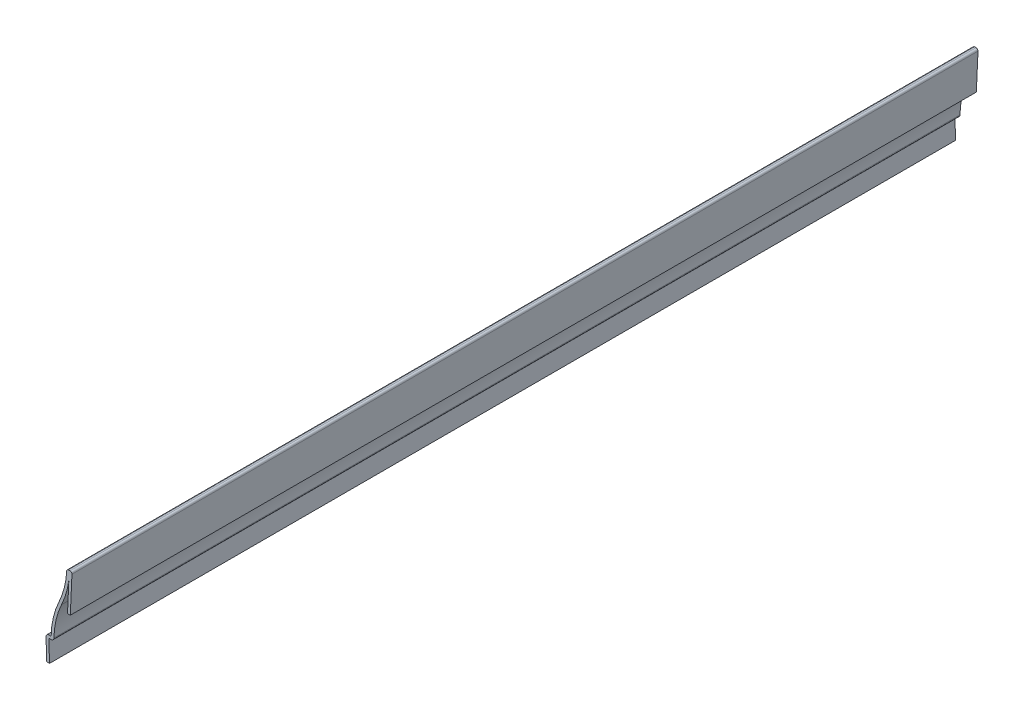
ISO-10303-21;
HEADER;
FILE_DESCRIPTION(('STEP AP214'),'2;1');
FILE_NAME('part.step','',(''),(''),'','','');
FILE_SCHEMA(('AUTOMOTIVE_DESIGN { 1 0 10303 214 1 1 1 1 }'));
ENDSEC;
DATA;
#1=APPLICATION_CONTEXT('core data for automotive mechanical design processes');
#2=APPLICATION_PROTOCOL_DEFINITION('international standard','automotive_design',2000,#1);
#3=PRODUCT_CONTEXT('',#1,'mechanical');
#4=PRODUCT('Part','Part','',(#3));
#5=PRODUCT_RELATED_PRODUCT_CATEGORY('part','',(#4));
#6=PRODUCT_DEFINITION_FORMATION('','',#4);
#7=PRODUCT_DEFINITION_CONTEXT('part definition',#1,'design');
#8=PRODUCT_DEFINITION('design','',#6,#7);
#9=PRODUCT_DEFINITION_SHAPE('','',#8);
#10=(LENGTH_UNIT() NAMED_UNIT(*) SI_UNIT(.MILLI.,.METRE.));
#11=(NAMED_UNIT(*) PLANE_ANGLE_UNIT() SI_UNIT($,.RADIAN.));
#12=(NAMED_UNIT(*) SI_UNIT($,.STERADIAN.) SOLID_ANGLE_UNIT());
#13=UNCERTAINTY_MEASURE_WITH_UNIT(LENGTH_MEASURE(1.E-05),#10,'distance_accuracy_value','');
#14=(GEOMETRIC_REPRESENTATION_CONTEXT(3) GLOBAL_UNCERTAINTY_ASSIGNED_CONTEXT((#13)) GLOBAL_UNIT_ASSIGNED_CONTEXT((#10,
#11,#12)) REPRESENTATION_CONTEXT('',''));
#15=CARTESIAN_POINT('',(0.,0.,0.));
#16=DIRECTION('',(0.,0.,1.));
#17=DIRECTION('',(1.,0.,0.));
#18=AXIS2_PLACEMENT_3D('',#15,#16,#17);
#19=CARTESIAN_POINT('',(10.2406849539329,41.299533746183,412.75));
#20=DIRECTION('',(0.9989685402103,-0.0454076609186499,0.));
#21=DIRECTION('',(0.0454076609186499,0.9989685402103,0.));
#22=AXIS2_PLACEMENT_3D('',#19,#20,#21);
#23=PLANE('',#22);
#24=DIRECTION('',(-0.0454076609186499,-0.9989685402103,0.));
#25=VECTOR('',#24,1.);
#26=CARTESIAN_POINT('',(10.2406849539329,41.299533746183,0.));
#27=LINE('',#26,#25);
#28=CARTESIAN_POINT('',(10.0568661927221,37.2555209995457,0.));
#29=VERTEX_POINT('',#28);
#30=CARTESIAN_POINT('',(9.44693495393292,23.837033746183,0.));
#31=VERTEX_POINT('',#30);
#32=EDGE_CURVE('E171',#29,#31,#27,.T.);
#33=ORIENTED_EDGE('',*,*,#32,.T.);
#34=DIRECTION('',(0.,0.,-1.));
#35=VECTOR('',#34,1.);
#36=CARTESIAN_POINT('',(9.44693495393292,23.837033746183,412.75));
#37=LINE('',#36,#35);
#38=CARTESIAN_POINT('',(9.44693495393292,23.837033746183,412.75));
#39=VERTEX_POINT('',#38);
#40=EDGE_CURVE('E169',#39,#31,#37,.T.);
#41=ORIENTED_EDGE('',*,*,#40,.F.);
#42=DIRECTION('',(-0.0454076609186499,-0.9989685402103,0.));
#43=VECTOR('',#42,1.);
#44=CARTESIAN_POINT('',(10.2406849539329,41.299533746183,412.75));
#45=LINE('',#44,#43);
#46=CARTESIAN_POINT('',(10.0568661927221,37.2555209995457,412.75));
#47=VERTEX_POINT('',#46);
#48=EDGE_CURVE('E156',#47,#39,#45,.T.);
#49=ORIENTED_EDGE('',*,*,#48,.F.);
#50=DIRECTION('',(0.,0.,-1.));
#51=VECTOR('',#50,1.);
#52=CARTESIAN_POINT('',(10.0568661927221,37.2555209995457,412.75));
#53=LINE('',#52,#51);
#54=EDGE_CURVE('E209',#47,#29,#53,.T.);
#55=ORIENTED_EDGE('',*,*,#54,.T.);
#56=EDGE_LOOP('',(#33,#41,#49,#55));
#57=FACE_BOUND('',#56,.T.);
#58=ADVANCED_FACE('F35',(#57),#23,.F.);
#59=CARTESIAN_POINT('',(10.715625,23.7793660168163,412.75));
#60=DIRECTION('',(-0.0454076609186449,-0.9989685402103,0.));
#61=DIRECTION('',(0.9989685402103,-0.0454076609186449,0.));
#62=AXIS2_PLACEMENT_3D('',#59,#60,#61);
#63=PLANE('',#62);
#64=DIRECTION('',(-0.9989685402103,0.0454076609186449,0.));
#65=VECTOR('',#64,1.);
#66=CARTESIAN_POINT('',(10.715625,23.7793660168163,0.));
#67=LINE('',#66,#65);
#68=CARTESIAN_POINT('',(10.715625,23.7793660168163,0.));
#69=VERTEX_POINT('',#68);
#70=EDGE_CURVE('E211',#69,#31,#67,.T.);
#71=ORIENTED_EDGE('',*,*,#70,.F.);
#72=DIRECTION('',(0.,0.,-1.));
#73=VECTOR('',#72,1.);
#74=CARTESIAN_POINT('',(10.715625,23.7793660168163,412.75));
#75=LINE('',#74,#73);
#76=CARTESIAN_POINT('',(10.715625,23.7793660168163,412.75));
#77=VERTEX_POINT('',#76);
#78=EDGE_CURVE('E176',#77,#69,#75,.T.);
#79=ORIENTED_EDGE('',*,*,#78,.F.);
#80=DIRECTION('',(-0.9989685402103,0.0454076609186449,0.));
#81=VECTOR('',#80,1.);
#82=CARTESIAN_POINT('',(10.715625,23.7793660168163,412.75));
#83=LINE('',#82,#81);
#84=EDGE_CURVE('E160',#77,#39,#83,.T.);
#85=ORIENTED_EDGE('',*,*,#84,.T.);
#86=ORIENTED_EDGE('',*,*,#40,.T.);
#87=EDGE_LOOP('',(#71,#79,#85,#86));
#88=FACE_BOUND('',#87,.T.);
#89=ADVANCED_FACE('F179',(#88),#63,.T.);
#90=CARTESIAN_POINT('',(11.509375,41.2418660168163,412.75));
#91=DIRECTION('',(0.9989685402103,-0.0454076609186499,0.));
#92=DIRECTION('',(0.0454076609186499,0.9989685402103,0.));
#93=AXIS2_PLACEMENT_3D('',#90,#91,#92);
#94=PLANE('',#93);
#95=DIRECTION('',(-0.0454076609186499,-0.998968540210299,0.));
#96=VECTOR('',#95,1.);
#97=CARTESIAN_POINT('',(11.509375,41.2418660168163,0.));
#98=LINE('',#97,#96);
#99=CARTESIAN_POINT('',(11.4677151577528,40.3253494873782,0.));
#100=VERTEX_POINT('',#99);
#101=EDGE_CURVE('E213',#100,#69,#98,.T.);
#102=ORIENTED_EDGE('',*,*,#101,.F.);
#103=DIRECTION('',(0.,0.,-1.));
#104=VECTOR('',#103,1.);
#105=CARTESIAN_POINT('',(11.4677151577528,40.3253494873782,412.75));
#106=LINE('',#105,#104);
#107=CARTESIAN_POINT('',(11.4677151577528,40.3253494873782,412.75));
#108=VERTEX_POINT('',#107);
#109=EDGE_CURVE('E58',#100,#108,#106,.F.);
#110=ORIENTED_EDGE('',*,*,#109,.T.);
#111=DIRECTION('',(-0.0454076609186499,-0.998968540210299,0.));
#112=VECTOR('',#111,1.);
#113=CARTESIAN_POINT('',(11.509375,41.2418660168163,412.75));
#114=LINE('',#113,#112);
#115=EDGE_CURVE('E181',#108,#77,#114,.T.);
#116=ORIENTED_EDGE('',*,*,#115,.T.);
#117=ORIENTED_EDGE('',*,*,#78,.T.);
#118=EDGE_LOOP('',(#102,#110,#116,#117));
#119=FACE_BOUND('',#118,.T.);
#120=ADVANCED_FACE('F294',(#119),#94,.T.);
#121=CARTESIAN_POINT('',(9.128125,41.275,412.75));
#122=DIRECTION('',(0.0139131867900406,0.999903206932224,0.));
#123=DIRECTION('',(-0.999903206932224,0.0139131867900406,0.));
#124=AXIS2_PLACEMENT_3D('',#121,#122,#123);
#125=PLANE('',#124);
#126=DIRECTION('',(0.999903206932224,-0.0139131867900406,0.));
#127=VECTOR('',#126,1.);
#128=CARTESIAN_POINT('',(9.128125,41.275,412.75));
#129=LINE('',#128,#127);
#130=CARTESIAN_POINT('',(9.98898045100242,41.2630215978847,412.75));
#131=VERTEX_POINT('',#130);
#132=CARTESIAN_POINT('',(10.5920009485622,41.2546308488976,412.75));
#133=VERTEX_POINT('',#132);
#134=EDGE_CURVE('E183',#131,#133,#129,.T.);
#135=ORIENTED_EDGE('',*,*,#134,.T.);
#136=DIRECTION('',(0.,0.,-1.));
#137=VECTOR('',#136,1.);
#138=CARTESIAN_POINT('',(10.5920009485622,41.2546308488976,412.75));
#139=LINE('',#138,#137);
#140=CARTESIAN_POINT('',(10.5920009485622,41.2546308488976,0.));
#141=VERTEX_POINT('',#140);
#142=EDGE_CURVE('E276',#133,#141,#139,.T.);
#143=ORIENTED_EDGE('',*,*,#142,.T.);
#144=DIRECTION('',(0.999903206932224,-0.0139131867900406,0.));
#145=VECTOR('',#144,1.);
#146=CARTESIAN_POINT('',(9.128125,41.275,0.));
#147=LINE('',#146,#145);
#148=CARTESIAN_POINT('',(9.98898045100242,41.2630215978847,0.));
#149=VERTEX_POINT('',#148);
#150=EDGE_CURVE('E215',#149,#141,#147,.T.);
#151=ORIENTED_EDGE('',*,*,#150,.F.);
#152=DIRECTION('',(0.,0.,-1.));
#153=VECTOR('',#152,1.);
#154=CARTESIAN_POINT('',(9.98898045100242,41.2630215978847,412.75));
#155=LINE('',#154,#153);
#156=EDGE_CURVE('E274',#149,#131,#155,.F.);
#157=ORIENTED_EDGE('',*,*,#156,.T.);
#158=EDGE_LOOP('',(#135,#143,#151,#157));
#159=FACE_BOUND('',#158,.T.);
#160=ADVANCED_FACE('F288',(#159),#125,.T.);
#161=CARTESIAN_POINT('',(-28.9488752659756,42.598650537301,412.75));
#162=DIRECTION('',(0.,0.,-1.));
#163=DIRECTION('',(-1.,0.,0.));
#164=AXIS2_PLACEMENT_3D('',#161,#162,#163);
#165=CYLINDRICAL_SURFACE('',#164,38.1);
#166=CARTESIAN_POINT('',(-28.9488752659756,42.598650537301,412.75));
#167=DIRECTION('',(0.,0.,1.));
#168=DIRECTION('',(1.,0.,0.));
#169=AXIS2_PLACEMENT_3D('',#166,#167,#168);
#170=CIRCLE('',#169,38.1);
#171=CARTESIAN_POINT('',(5.56361530375138,26.4587002686505,412.75));
#172=VERTEX_POINT('',#171);
#173=CARTESIAN_POINT('',(9.0890598095179,40.4248301232498,412.75));
#174=VERTEX_POINT('',#173);
#175=EDGE_CURVE('E188',#172,#174,#170,.T.);
#176=ORIENTED_EDGE('',*,*,#175,.T.);
#177=DIRECTION('',(0.,0.,-1.));
#178=VECTOR('',#177,1.);
#179=CARTESIAN_POINT('',(9.0890598095179,40.4248301232498,412.75));
#180=LINE('',#179,#178);
#181=CARTESIAN_POINT('',(9.0890598095179,40.4248301232498,0.));
#182=VERTEX_POINT('',#181);
#183=EDGE_CURVE('E11',#174,#182,#180,.T.);
#184=ORIENTED_EDGE('',*,*,#183,.T.);
#185=CARTESIAN_POINT('',(-28.9488752659756,42.598650537301,0.));
#186=DIRECTION('',(0.,0.,1.));
#187=DIRECTION('',(1.,0.,0.));
#188=AXIS2_PLACEMENT_3D('',#185,#186,#187);
#189=CIRCLE('',#188,38.1);
#190=CARTESIAN_POINT('',(5.56361530375138,26.4587002686505,0.));
#191=VERTEX_POINT('',#190);
#192=EDGE_CURVE('E218',#191,#182,#189,.T.);
#193=ORIENTED_EDGE('',*,*,#192,.F.);
#194=DIRECTION('',(0.,0.,-1.));
#195=VECTOR('',#194,1.);
#196=CARTESIAN_POINT('',(5.56361530375138,26.4587002686505,412.75));
#197=LINE('',#196,#195);
#198=EDGE_CURVE('E254',#172,#191,#197,.T.);
#199=ORIENTED_EDGE('',*,*,#198,.F.);
#200=EDGE_LOOP('',(#176,#184,#193,#199));
#201=FACE_BOUND('',#200,.T.);
#202=ADVANCED_FACE('F341',(#201),#165,.F.);
#203=CARTESIAN_POINT('',(40.0761058734783,10.31875,412.75));
#204=DIRECTION('',(0.,0.,-1.));
#205=DIRECTION('',(-1.,0.,0.));
#206=AXIS2_PLACEMENT_3D('',#203,#204,#205);
#207=CYLINDRICAL_SURFACE('',#206,38.1);
#208=CARTESIAN_POINT('',(40.0761058734783,10.31875,0.));
#209=DIRECTION('',(0.,0.,-1.));
#210=DIRECTION('',(-1.,0.,0.));
#211=AXIS2_PLACEMENT_3D('',#208,#209,#210);
#212=CIRCLE('',#211,38.1);
#213=CARTESIAN_POINT('',(1.984375,11.1125,0.));
#214=VERTEX_POINT('',#213);
#215=EDGE_CURVE('E221',#214,#191,#212,.T.);
#216=ORIENTED_EDGE('',*,*,#215,.F.);
#217=DIRECTION('',(0.,0.,-1.));
#218=VECTOR('',#217,1.);
#219=CARTESIAN_POINT('',(1.984375,11.1125,412.75));
#220=LINE('',#219,#218);
#221=CARTESIAN_POINT('',(1.984375,11.1125,412.75));
#222=VERTEX_POINT('',#221);
#223=EDGE_CURVE('E251',#222,#214,#220,.T.);
#224=ORIENTED_EDGE('',*,*,#223,.F.);
#225=CARTESIAN_POINT('',(40.0761058734783,10.31875,412.75));
#226=DIRECTION('',(0.,0.,-1.));
#227=DIRECTION('',(-1.,0.,0.));
#228=AXIS2_PLACEMENT_3D('',#225,#226,#227);
#229=CIRCLE('',#228,38.1);
#230=EDGE_CURVE('E190',#222,#172,#229,.T.);
#231=ORIENTED_EDGE('',*,*,#230,.T.);
#232=ORIENTED_EDGE('',*,*,#198,.T.);
#233=EDGE_LOOP('',(#216,#224,#231,#232));
#234=FACE_BOUND('',#233,.T.);
#235=ADVANCED_FACE('F338',(#234),#207,.T.);
#236=CARTESIAN_POINT('',(-0.396875000000001,11.1125,412.75));
#237=DIRECTION('',(0.,1.,0.));
#238=DIRECTION('',(0.,0.,1.));
#239=AXIS2_PLACEMENT_3D('',#236,#237,#238);
#240=PLANE('',#239);
#241=DIRECTION('',(1.,0.,0.));
#242=VECTOR('',#241,1.);
#243=CARTESIAN_POINT('',(-0.396875000000001,11.1125,0.));
#244=LINE('',#243,#242);
#245=CARTESIAN_POINT('',(0.919291833726771,11.1125,0.));
#246=VERTEX_POINT('',#245);
#247=EDGE_CURVE('E224',#246,#214,#244,.T.);
#248=ORIENTED_EDGE('',*,*,#247,.F.);
#249=DIRECTION('',(0.,0.,-1.));
#250=VECTOR('',#249,1.);
#251=CARTESIAN_POINT('',(0.919291833726771,11.1125,412.75));
#252=LINE('',#251,#250);
#253=CARTESIAN_POINT('',(0.919291833726771,11.1125,412.75));
#254=VERTEX_POINT('',#253);
#255=EDGE_CURVE('E272',#246,#254,#252,.F.);
#256=ORIENTED_EDGE('',*,*,#255,.T.);
#257=DIRECTION('',(1.,0.,0.));
#258=VECTOR('',#257,1.);
#259=CARTESIAN_POINT('',(-0.396875000000001,11.1125,412.75));
#260=LINE('',#259,#258);
#261=EDGE_CURVE('E193',#254,#222,#260,.T.);
#262=ORIENTED_EDGE('',*,*,#261,.T.);
#263=ORIENTED_EDGE('',*,*,#223,.T.);
#264=EDGE_LOOP('',(#248,#256,#262,#263));
#265=FACE_BOUND('',#264,.T.);
#266=ADVANCED_FACE('F330',(#265),#240,.T.);
#267=CARTESIAN_POINT('',(0.,0.,412.75));
#268=DIRECTION('',(-0.99936285434755,-0.0356915305124126,0.));
#269=DIRECTION('',(0.0356915305124126,-0.99936285434755,0.));
#270=AXIS2_PLACEMENT_3D('',#267,#268,#269);
#271=PLANE('',#270);
#272=DIRECTION('',(-0.0356915305124126,0.999362854347549,0.));
#273=VECTOR('',#272,1.);
#274=CARTESIAN_POINT('',(0.,0.,412.75));
#275=LINE('',#274,#273);
#276=CARTESIAN_POINT('',(0.,0.,412.75));
#277=VERTEX_POINT('',#276);
#278=CARTESIAN_POINT('',(-0.349898991294617,9.79717175624923,412.75));
#279=VERTEX_POINT('',#278);
#280=EDGE_CURVE('E195',#277,#279,#275,.T.);
#281=ORIENTED_EDGE('',*,*,#280,.T.);
#282=DIRECTION('',(0.,0.,-1.));
#283=VECTOR('',#282,1.);
#284=CARTESIAN_POINT('',(-0.349898991294617,9.79717175624924,412.75));
#285=LINE('',#284,#283);
#286=CARTESIAN_POINT('',(-0.349898991294617,9.79717175624923,0.));
#287=VERTEX_POINT('',#286);
#288=EDGE_CURVE('E269',#279,#287,#285,.T.);
#289=ORIENTED_EDGE('',*,*,#288,.T.);
#290=DIRECTION('',(-0.0356915305124126,0.999362854347549,0.));
#291=VECTOR('',#290,1.);
#292=CARTESIAN_POINT('',(0.,0.,0.));
#293=LINE('',#292,#291);
#294=CARTESIAN_POINT('',(0.,0.,0.));
#295=VERTEX_POINT('',#294);
#296=EDGE_CURVE('E226',#295,#287,#293,.T.);
#297=ORIENTED_EDGE('',*,*,#296,.F.);
#298=DIRECTION('',(0.,0.,-1.));
#299=VECTOR('',#298,1.);
#300=CARTESIAN_POINT('',(0.,0.,412.75));
#301=LINE('',#300,#299);
#302=EDGE_CURVE('E249',#277,#295,#301,.T.);
#303=ORIENTED_EDGE('',*,*,#302,.F.);
#304=EDGE_LOOP('',(#281,#289,#297,#303));
#305=FACE_BOUND('',#304,.T.);
#306=ADVANCED_FACE('F324',(#305),#271,.T.);
#307=CARTESIAN_POINT('',(1.26919082502139,0.045328243750764,412.75));
#308=DIRECTION('',(0.0356915305124126,-0.99936285434755,0.));
#309=DIRECTION('',(0.99936285434755,0.0356915305124126,0.));
#310=AXIS2_PLACEMENT_3D('',#307,#308,#309);
#311=PLANE('',#310);
#312=DIRECTION('',(-0.999362854347549,-0.0356915305124126,0.));
#313=VECTOR('',#312,1.);
#314=CARTESIAN_POINT('',(1.26919082502139,0.045328243750764,0.));
#315=LINE('',#314,#313);
#316=CARTESIAN_POINT('',(1.26919082502139,0.045328243750764,0.));
#317=VERTEX_POINT('',#316);
#318=EDGE_CURVE('E229',#317,#295,#315,.T.);
#319=ORIENTED_EDGE('',*,*,#318,.F.);
#320=DIRECTION('',(0.,0.,-1.));
#321=VECTOR('',#320,1.);
#322=CARTESIAN_POINT('',(1.26919082502139,0.045328243750764,412.75));
#323=LINE('',#322,#321);
#324=CARTESIAN_POINT('',(1.26919082502139,0.045328243750764,412.75));
#325=VERTEX_POINT('',#324);
#326=EDGE_CURVE('E247',#325,#317,#323,.T.);
#327=ORIENTED_EDGE('',*,*,#326,.F.);
#328=DIRECTION('',(-0.999362854347549,-0.0356915305124126,0.));
#329=VECTOR('',#328,1.);
#330=CARTESIAN_POINT('',(1.26919082502139,0.045328243750764,412.75));
#331=LINE('',#330,#329);
#332=EDGE_CURVE('E198',#325,#277,#331,.T.);
#333=ORIENTED_EDGE('',*,*,#332,.T.);
#334=ORIENTED_EDGE('',*,*,#302,.T.);
#335=EDGE_LOOP('',(#319,#327,#333,#334));
#336=FACE_BOUND('',#335,.T.);
#337=ADVANCED_FACE('F320',(#336),#311,.T.);
#338=CARTESIAN_POINT('',(1.26919082502139,0.045328243750764,412.75));
#339=DIRECTION('',(-0.99936285434755,-0.0356915305124126,0.));
#340=DIRECTION('',(0.0356915305124126,-0.99936285434755,0.));
#341=AXIS2_PLACEMENT_3D('',#338,#339,#340);
#342=PLANE('',#341);
#343=DIRECTION('',(-0.0356915305124126,0.99936285434755,0.));
#344=VECTOR('',#343,1.);
#345=CARTESIAN_POINT('',(1.26919082502139,0.045328243750764,0.));
#346=LINE('',#345,#344);
#347=CARTESIAN_POINT('',(0.919291833726771,9.8425,0.));
#348=VERTEX_POINT('',#347);
#349=EDGE_CURVE('E232',#317,#348,#346,.T.);
#350=ORIENTED_EDGE('',*,*,#349,.T.);
#351=DIRECTION('',(0.,0.,-1.));
#352=VECTOR('',#351,1.);
#353=CARTESIAN_POINT('',(0.919291833726771,9.8425,412.75));
#354=LINE('',#353,#352);
#355=CARTESIAN_POINT('',(0.919291833726771,9.8425,412.75));
#356=VERTEX_POINT('',#355);
#357=EDGE_CURVE('E244',#356,#348,#354,.T.);
#358=ORIENTED_EDGE('',*,*,#357,.F.);
#359=DIRECTION('',(-0.0356915305124126,0.99936285434755,0.));
#360=VECTOR('',#359,1.);
#361=CARTESIAN_POINT('',(1.26919082502139,0.045328243750764,412.75));
#362=LINE('',#361,#360);
#363=EDGE_CURVE('E201',#325,#356,#362,.T.);
#364=ORIENTED_EDGE('',*,*,#363,.F.);
#365=ORIENTED_EDGE('',*,*,#326,.T.);
#366=EDGE_LOOP('',(#350,#358,#364,#365));
#367=FACE_BOUND('',#366,.T.);
#368=ADVANCED_FACE('F316',(#367),#342,.F.);
#369=CARTESIAN_POINT('',(-0.396875000000001,9.8425,412.75));
#370=DIRECTION('',(0.,1.,0.));
#371=DIRECTION('',(0.,0.,1.));
#372=AXIS2_PLACEMENT_3D('',#369,#370,#371);
#373=PLANE('',#372);
#374=DIRECTION('',(1.,0.,0.));
#375=VECTOR('',#374,1.);
#376=CARTESIAN_POINT('',(-0.396875000000001,9.8425,0.));
#377=LINE('',#376,#375);
#378=CARTESIAN_POINT('',(1.984375,9.8425,0.));
#379=VERTEX_POINT('',#378);
#380=EDGE_CURVE('E234',#348,#379,#377,.T.);
#381=ORIENTED_EDGE('',*,*,#380,.T.);
#382=DIRECTION('',(0.,0.,-1.));
#383=VECTOR('',#382,1.);
#384=CARTESIAN_POINT('',(1.984375,9.8425,412.75));
#385=LINE('',#384,#383);
#386=CARTESIAN_POINT('',(1.984375,9.8425,412.75));
#387=VERTEX_POINT('',#386);
#388=EDGE_CURVE('E263',#379,#387,#385,.F.);
#389=ORIENTED_EDGE('',*,*,#388,.T.);
#390=DIRECTION('',(1.,0.,0.));
#391=VECTOR('',#390,1.);
#392=CARTESIAN_POINT('',(-0.396875000000001,9.8425,412.75));
#393=LINE('',#392,#391);
#394=EDGE_CURVE('E203',#356,#387,#393,.T.);
#395=ORIENTED_EDGE('',*,*,#394,.F.);
#396=ORIENTED_EDGE('',*,*,#357,.T.);
#397=EDGE_LOOP('',(#381,#389,#395,#396));
#398=FACE_BOUND('',#397,.T.);
#399=ADVANCED_FACE('F311',(#398),#373,.F.);
#400=CARTESIAN_POINT('',(40.0761058734783,10.31875,412.75));
#401=DIRECTION('',(0.,0.,-1.));
#402=DIRECTION('',(-1.,0.,0.));
#403=AXIS2_PLACEMENT_3D('',#400,#401,#402);
#404=CYLINDRICAL_SURFACE('',#403,36.83);
#405=CARTESIAN_POINT('',(40.0761058734783,10.31875,412.75));
#406=DIRECTION('',(0.,0.,1.));
#407=DIRECTION('',(1.,0.,0.));
#408=AXIS2_PLACEMENT_3D('',#405,#406,#407);
#409=CIRCLE('',#408,36.83);
#410=CARTESIAN_POINT('',(3.25409936244927,11.0860416666667,412.75));
#411=VERTEX_POINT('',#410);
#412=CARTESIAN_POINT('',(6.7140316560756,25.9207019263621,412.75));
#413=VERTEX_POINT('',#412);
#414=EDGE_CURVE('E206',#411,#413,#409,.F.);
#415=ORIENTED_EDGE('',*,*,#414,.F.);
#416=DIRECTION('',(0.,0.,-1.));
#417=VECTOR('',#416,1.);
#418=CARTESIAN_POINT('',(3.25409936244927,11.0860416666667,412.75));
#419=LINE('',#418,#417);
#420=CARTESIAN_POINT('',(3.25409936244927,11.0860416666667,0.));
#421=VERTEX_POINT('',#420);
#422=EDGE_CURVE('E175',#411,#421,#419,.T.);
#423=ORIENTED_EDGE('',*,*,#422,.T.);
#424=CARTESIAN_POINT('',(40.0761058734783,10.31875,0.));
#425=DIRECTION('',(0.,0.,1.));
#426=DIRECTION('',(1.,0.,0.));
#427=AXIS2_PLACEMENT_3D('',#424,#425,#426);
#428=CIRCLE('',#427,36.83);
#429=CARTESIAN_POINT('',(6.7140316560756,25.9207019263621,0.));
#430=VERTEX_POINT('',#429);
#431=EDGE_CURVE('E237',#421,#430,#428,.F.);
#432=ORIENTED_EDGE('',*,*,#431,.T.);
#433=DIRECTION('',(0.,0.,-1.));
#434=VECTOR('',#433,1.);
#435=CARTESIAN_POINT('',(6.7140316560756,25.9207019263621,412.75));
#436=LINE('',#435,#434);
#437=EDGE_CURVE('E241',#413,#430,#436,.T.);
#438=ORIENTED_EDGE('',*,*,#437,.F.);
#439=EDGE_LOOP('',(#415,#423,#432,#438));
#440=FACE_BOUND('',#439,.T.);
#441=ADVANCED_FACE('F302',(#440),#404,.F.);
#442=CARTESIAN_POINT('',(-28.9488752659756,42.598650537301,412.75));
#443=DIRECTION('',(0.,0.,-1.));
#444=DIRECTION('',(-1.,0.,0.));
#445=AXIS2_PLACEMENT_3D('',#442,#443,#444);
#446=CYLINDRICAL_SURFACE('',#445,39.37);
#447=CARTESIAN_POINT('',(-28.9488752659756,42.598650537301,0.));
#448=DIRECTION('',(0.,0.,1.));
#449=DIRECTION('',(1.,0.,0.));
#450=AXIS2_PLACEMENT_3D('',#447,#448,#449);
#451=CIRCLE('',#450,39.37);
#452=EDGE_CURVE('E166',#430,#29,#451,.T.);
#453=ORIENTED_EDGE('',*,*,#452,.T.);
#454=ORIENTED_EDGE('',*,*,#54,.F.);
#455=CARTESIAN_POINT('',(-28.9488752659756,42.598650537301,412.75));
#456=DIRECTION('',(0.,0.,1.));
#457=DIRECTION('',(1.,0.,0.));
#458=AXIS2_PLACEMENT_3D('',#455,#456,#457);
#459=CIRCLE('',#458,39.37);
#460=EDGE_CURVE('E162',#413,#47,#459,.T.);
#461=ORIENTED_EDGE('',*,*,#460,.F.);
#462=ORIENTED_EDGE('',*,*,#437,.T.);
#463=EDGE_LOOP('',(#453,#454,#461,#462));
#464=FACE_BOUND('',#463,.T.);
#465=ADVANCED_FACE('F298',(#464),#446,.T.);
#466=CARTESIAN_POINT('',(-28.9488752659756,42.598650537301,412.75));
#467=DIRECTION('',(0.,0.,1.));
#468=DIRECTION('',(1.,0.,0.));
#469=AXIS2_PLACEMENT_3D('',#466,#467,#468);
#470=PLANE('',#469);
#471=ORIENTED_EDGE('',*,*,#115,.F.);
#472=CARTESIAN_POINT('',(10.5796321255059,40.3657168979348,412.75));
#473=DIRECTION('',(0.,0.,1.));
#474=DIRECTION('',(1.,0.,0.));
#475=AXIS2_PLACEMENT_3D('',#472,#473,#474);
#476=CIRCLE('',#475,0.889);
#477=EDGE_CURVE('E43',#108,#133,#476,.T.);
#478=ORIENTED_EDGE('',*,*,#477,.T.);
#479=ORIENTED_EDGE('',*,*,#134,.F.);
#480=CARTESIAN_POINT('',(9.97661162794607,40.3741076469219,412.75));
#481=DIRECTION('',(0.,0.,1.));
#482=DIRECTION('',(1.,0.,0.));
#483=AXIS2_PLACEMENT_3D('',#480,#481,#482);
#484=CIRCLE('',#483,0.889);
#485=EDGE_CURVE('E50',#131,#174,#484,.T.);
#486=ORIENTED_EDGE('',*,*,#485,.T.);
#487=ORIENTED_EDGE('',*,*,#175,.F.);
#488=ORIENTED_EDGE('',*,*,#230,.F.);
#489=ORIENTED_EDGE('',*,*,#261,.F.);
#490=CARTESIAN_POINT('',(0.919291833726771,9.8425,412.75));
#491=DIRECTION('',(0.,0.,1.));
#492=DIRECTION('',(1.,0.,0.));
#493=AXIS2_PLACEMENT_3D('',#490,#491,#492);
#494=CIRCLE('',#493,1.27);
#495=EDGE_CURVE('E265',#254,#279,#494,.T.);
#496=ORIENTED_EDGE('',*,*,#495,.T.);
#497=ORIENTED_EDGE('',*,*,#280,.F.);
#498=ORIENTED_EDGE('',*,*,#332,.F.);
#499=ORIENTED_EDGE('',*,*,#363,.T.);
#500=ORIENTED_EDGE('',*,*,#394,.T.);
#501=CARTESIAN_POINT('',(1.984375,11.1125,412.75));
#502=DIRECTION('',(0.,0.,1.));
#503=DIRECTION('',(1.,0.,0.));
#504=AXIS2_PLACEMENT_3D('',#501,#502,#503);
#505=CIRCLE('',#504,1.27);
#506=EDGE_CURVE('E267',#387,#411,#505,.T.);
#507=ORIENTED_EDGE('',*,*,#506,.T.);
#508=ORIENTED_EDGE('',*,*,#414,.T.);
#509=ORIENTED_EDGE('',*,*,#460,.T.);
#510=ORIENTED_EDGE('',*,*,#48,.T.);
#511=ORIENTED_EDGE('',*,*,#84,.F.);
#512=EDGE_LOOP('',(#471,#478,#479,#486,#487,#488,#489,#496,#497,#498,#499,#500,#507,#508,#509,
#510,#511));
#513=FACE_BOUND('',#512,.T.);
#514=ADVANCED_FACE('F158',(#513),#470,.T.);
#515=CARTESIAN_POINT('',(-28.9488752659756,42.598650537301,0.));
#516=DIRECTION('',(0.,0.,1.));
#517=DIRECTION('',(1.,0.,0.));
#518=AXIS2_PLACEMENT_3D('',#515,#516,#517);
#519=PLANE('',#518);
#520=ORIENTED_EDGE('',*,*,#150,.T.);
#521=CARTESIAN_POINT('',(10.5796321255059,40.3657168979348,0.));
#522=DIRECTION('',(0.,0.,1.));
#523=DIRECTION('',(1.,0.,0.));
#524=AXIS2_PLACEMENT_3D('',#521,#522,#523);
#525=CIRCLE('',#524,0.889);
#526=EDGE_CURVE('E281',#141,#100,#525,.F.);
#527=ORIENTED_EDGE('',*,*,#526,.T.);
#528=ORIENTED_EDGE('',*,*,#101,.T.);
#529=ORIENTED_EDGE('',*,*,#70,.T.);
#530=ORIENTED_EDGE('',*,*,#32,.F.);
#531=ORIENTED_EDGE('',*,*,#452,.F.);
#532=ORIENTED_EDGE('',*,*,#431,.F.);
#533=CARTESIAN_POINT('',(1.984375,11.1125,0.));
#534=DIRECTION('',(0.,0.,1.));
#535=DIRECTION('',(1.,0.,0.));
#536=AXIS2_PLACEMENT_3D('',#533,#534,#535);
#537=CIRCLE('',#536,1.27);
#538=EDGE_CURVE('E261',#421,#379,#537,.F.);
#539=ORIENTED_EDGE('',*,*,#538,.T.);
#540=ORIENTED_EDGE('',*,*,#380,.F.);
#541=ORIENTED_EDGE('',*,*,#349,.F.);
#542=ORIENTED_EDGE('',*,*,#318,.T.);
#543=ORIENTED_EDGE('',*,*,#296,.T.);
#544=CARTESIAN_POINT('',(0.919291833726771,9.8425,0.));
#545=DIRECTION('',(0.,0.,1.));
#546=DIRECTION('',(1.,0.,0.));
#547=AXIS2_PLACEMENT_3D('',#544,#545,#546);
#548=CIRCLE('',#547,1.27);
#549=EDGE_CURVE('E259',#287,#246,#548,.F.);
#550=ORIENTED_EDGE('',*,*,#549,.T.);
#551=ORIENTED_EDGE('',*,*,#247,.T.);
#552=ORIENTED_EDGE('',*,*,#215,.T.);
#553=ORIENTED_EDGE('',*,*,#192,.T.);
#554=CARTESIAN_POINT('',(9.97661162794607,40.3741076469219,0.));
#555=DIRECTION('',(0.,0.,1.));
#556=DIRECTION('',(1.,0.,0.));
#557=AXIS2_PLACEMENT_3D('',#554,#555,#556);
#558=CIRCLE('',#557,0.889);
#559=EDGE_CURVE('E279',#182,#149,#558,.F.);
#560=ORIENTED_EDGE('',*,*,#559,.T.);
#561=EDGE_LOOP('',(#520,#527,#528,#529,#530,#531,#532,#539,#540,#541,#542,#543,#550,#551,#552,
#553,#560));
#562=FACE_BOUND('',#561,.T.);
#563=ADVANCED_FACE('F293',(#562),#519,.F.);
#564=CARTESIAN_POINT('',(1.984375,11.1125,412.75));
#565=DIRECTION('',(0.,0.,-1.));
#566=DIRECTION('',(-1.,0.,0.));
#567=AXIS2_PLACEMENT_3D('',#564,#565,#566);
#568=CYLINDRICAL_SURFACE('',#567,1.27);
#569=ORIENTED_EDGE('',*,*,#506,.F.);
#570=ORIENTED_EDGE('',*,*,#388,.F.);
#571=ORIENTED_EDGE('',*,*,#538,.F.);
#572=ORIENTED_EDGE('',*,*,#422,.F.);
#573=EDGE_LOOP('',(#569,#570,#571,#572));
#574=FACE_BOUND('',#573,.T.);
#575=ADVANCED_FACE('F306',(#574),#568,.T.);
#576=CARTESIAN_POINT('',(0.919291833726771,9.8425,412.75));
#577=DIRECTION('',(0.,0.,-1.));
#578=DIRECTION('',(-1.,0.,0.));
#579=AXIS2_PLACEMENT_3D('',#576,#577,#578);
#580=CYLINDRICAL_SURFACE('',#579,1.27);
#581=ORIENTED_EDGE('',*,*,#495,.F.);
#582=ORIENTED_EDGE('',*,*,#255,.F.);
#583=ORIENTED_EDGE('',*,*,#549,.F.);
#584=ORIENTED_EDGE('',*,*,#288,.F.);
#585=EDGE_LOOP('',(#581,#582,#583,#584));
#586=FACE_BOUND('',#585,.T.);
#587=ADVANCED_FACE('F335',(#586),#580,.T.);
#588=CARTESIAN_POINT('',(10.5796321255059,40.3657168979348,412.75));
#589=DIRECTION('',(0.,0.,-1.));
#590=DIRECTION('',(-1.,0.,0.));
#591=AXIS2_PLACEMENT_3D('',#588,#589,#590);
#592=CYLINDRICAL_SURFACE('',#591,0.889);
#593=ORIENTED_EDGE('',*,*,#477,.F.);
#594=ORIENTED_EDGE('',*,*,#109,.F.);
#595=ORIENTED_EDGE('',*,*,#526,.F.);
#596=ORIENTED_EDGE('',*,*,#142,.F.);
#597=EDGE_LOOP('',(#593,#594,#595,#596));
#598=FACE_BOUND('',#597,.T.);
#599=ADVANCED_FACE('F291',(#598),#592,.T.);
#600=CARTESIAN_POINT('',(9.97661162794607,40.3741076469219,412.75));
#601=DIRECTION('',(0.,0.,-1.));
#602=DIRECTION('',(-1.,0.,0.));
#603=AXIS2_PLACEMENT_3D('',#600,#601,#602);
#604=CYLINDRICAL_SURFACE('',#603,0.889);
#605=ORIENTED_EDGE('',*,*,#485,.F.);
#606=ORIENTED_EDGE('',*,*,#156,.F.);
#607=ORIENTED_EDGE('',*,*,#559,.F.);
#608=ORIENTED_EDGE('',*,*,#183,.F.);
#609=EDGE_LOOP('',(#605,#606,#607,#608));
#610=FACE_BOUND('',#609,.T.);
#611=ADVANCED_FACE('F37',(#610),#604,.T.);
#612=CLOSED_SHELL('',(#58,#89,#120,#160,#202,#235,#266,#306,#337,#368,#399,#441,#465,#514,#563,
#575,#587,#599,#611));
#613=MANIFOLD_SOLID_BREP('B2',#612);
#614=ADVANCED_BREP_SHAPE_REPRESENTATION('',(#18,#613),#14);
#615=SHAPE_DEFINITION_REPRESENTATION(#9,#614);
ENDSEC;
END-ISO-10303-21;
